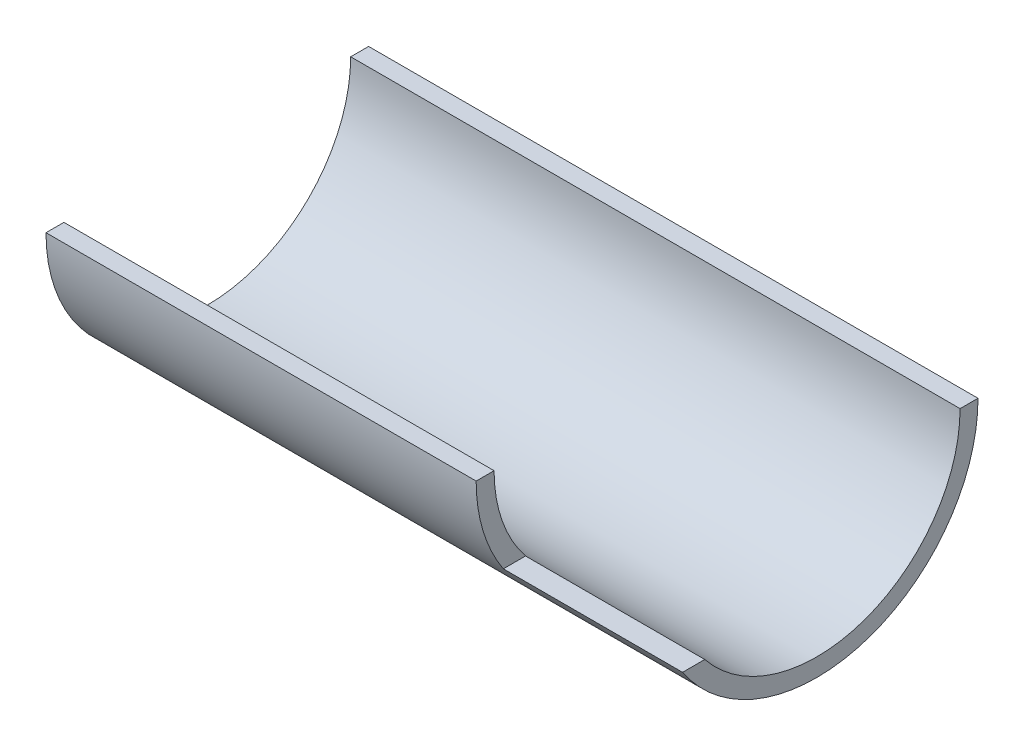
ISO-10303-21;
HEADER;
FILE_DESCRIPTION(('STEP AP214'),'2;1');
FILE_NAME('part.step','',(''),(''),'','','');
FILE_SCHEMA(('AUTOMOTIVE_DESIGN { 1 0 10303 214 1 1 1 1 }'));
ENDSEC;
DATA;
#1=APPLICATION_CONTEXT('core data for automotive mechanical design processes');
#2=APPLICATION_PROTOCOL_DEFINITION('international standard','automotive_design',2000,#1);
#3=PRODUCT_CONTEXT('',#1,'mechanical');
#4=PRODUCT('Part','Part','',(#3));
#5=PRODUCT_RELATED_PRODUCT_CATEGORY('part','',(#4));
#6=PRODUCT_DEFINITION_FORMATION('','',#4);
#7=PRODUCT_DEFINITION_CONTEXT('part definition',#1,'design');
#8=PRODUCT_DEFINITION('design','',#6,#7);
#9=PRODUCT_DEFINITION_SHAPE('','',#8);
#10=(LENGTH_UNIT() NAMED_UNIT(*) SI_UNIT(.MILLI.,.METRE.));
#11=(NAMED_UNIT(*) PLANE_ANGLE_UNIT() SI_UNIT($,.RADIAN.));
#12=(NAMED_UNIT(*) SI_UNIT($,.STERADIAN.) SOLID_ANGLE_UNIT());
#13=UNCERTAINTY_MEASURE_WITH_UNIT(LENGTH_MEASURE(1.E-05),#10,'distance_accuracy_value','');
#14=(GEOMETRIC_REPRESENTATION_CONTEXT(3) GLOBAL_UNCERTAINTY_ASSIGNED_CONTEXT((#13)) GLOBAL_UNIT_ASSIGNED_CONTEXT((#10,
#11,#12)) REPRESENTATION_CONTEXT('',''));
#15=CARTESIAN_POINT('',(0.,0.,0.));
#16=DIRECTION('',(0.,0.,1.));
#17=DIRECTION('',(1.,0.,0.));
#18=AXIS2_PLACEMENT_3D('',#15,#16,#17);
#19=CARTESIAN_POINT('',(-107.95,0.,25.4));
#20=DIRECTION('',(0.,1.,0.));
#21=DIRECTION('',(0.,0.,1.));
#22=AXIS2_PLACEMENT_3D('',#19,#20,#21);
#23=PLANE('',#22);
#24=DIRECTION('',(0.,0.,1.));
#25=VECTOR('',#24,1.);
#26=CARTESIAN_POINT('',(-107.95,0.,25.4));
#27=LINE('',#26,#25);
#28=CARTESIAN_POINT('',(-107.95,0.,25.4));
#29=VERTEX_POINT('',#28);
#30=CARTESIAN_POINT('',(-107.95,0.,28.575));
#31=VERTEX_POINT('',#30);
#32=EDGE_CURVE('E114',#29,#31,#27,.T.);
#33=ORIENTED_EDGE('',*,*,#32,.T.);
#34=DIRECTION('',(1.,0.,0.));
#35=VECTOR('',#34,1.);
#36=CARTESIAN_POINT('',(-107.95,0.,28.575));
#37=LINE('',#36,#35);
#38=CARTESIAN_POINT('',(-31.75,0.,28.575));
#39=VERTEX_POINT('',#38);
#40=EDGE_CURVE('E100',#31,#39,#37,.T.);
#41=ORIENTED_EDGE('',*,*,#40,.T.);
#42=DIRECTION('',(0.,0.,-1.));
#43=VECTOR('',#42,1.);
#44=CARTESIAN_POINT('',(-31.75,0.,127.));
#45=LINE('',#44,#43);
#46=CARTESIAN_POINT('',(-31.75,0.,25.4));
#47=VERTEX_POINT('',#46);
#48=EDGE_CURVE('E107',#39,#47,#45,.T.);
#49=ORIENTED_EDGE('',*,*,#48,.T.);
#50=DIRECTION('',(1.,0.,0.));
#51=VECTOR('',#50,1.);
#52=CARTESIAN_POINT('',(-107.95,0.,25.4));
#53=LINE('',#52,#51);
#54=EDGE_CURVE('E113',#29,#47,#53,.T.);
#55=ORIENTED_EDGE('',*,*,#54,.F.);
#56=EDGE_LOOP('',(#33,#41,#49,#55));
#57=FACE_BOUND('',#56,.T.);
#58=ADVANCED_FACE('F34',(#57),#23,.T.);
#59=CARTESIAN_POINT('',(0.,0.,0.));
#60=DIRECTION('',(1.,0.,0.));
#61=DIRECTION('',(0.,0.,-1.));
#62=AXIS2_PLACEMENT_3D('',#59,#60,#61);
#63=PLANE('',#62);
#64=DIRECTION('',(0.,0.,1.));
#65=VECTOR('',#64,1.);
#66=CARTESIAN_POINT('',(0.,-15.875,0.));
#67=LINE('',#66,#65);
#68=CARTESIAN_POINT('',(0.,-15.875,19.8278686449149));
#69=VERTEX_POINT('',#68);
#70=CARTESIAN_POINT('',(0.,-15.875,23.7595244060145));
#71=VERTEX_POINT('',#70);
#72=EDGE_CURVE('E42',#69,#71,#67,.T.);
#73=ORIENTED_EDGE('',*,*,#72,.T.);
#74=CARTESIAN_POINT('',(0.,0.,0.));
#75=DIRECTION('',(1.,0.,0.));
#76=DIRECTION('',(0.,0.,-1.));
#77=AXIS2_PLACEMENT_3D('',#74,#75,#76);
#78=CIRCLE('',#77,28.575);
#79=CARTESIAN_POINT('',(0.,0.,-28.575));
#80=VERTEX_POINT('',#79);
#81=EDGE_CURVE('E49',#71,#80,#78,.T.);
#82=ORIENTED_EDGE('',*,*,#81,.T.);
#83=DIRECTION('',(0.,0.,1.));
#84=VECTOR('',#83,1.);
#85=CARTESIAN_POINT('',(0.,0.,-31.75));
#86=LINE('',#85,#84);
#87=CARTESIAN_POINT('',(0.,0.,-25.4));
#88=VERTEX_POINT('',#87);
#89=EDGE_CURVE('E68',#80,#88,#86,.T.);
#90=ORIENTED_EDGE('',*,*,#89,.T.);
#91=CARTESIAN_POINT('',(0.,0.,0.));
#92=DIRECTION('',(-1.,0.,0.));
#93=DIRECTION('',(0.,0.,-1.));
#94=AXIS2_PLACEMENT_3D('',#91,#92,#93);
#95=CIRCLE('',#94,25.4);
#96=EDGE_CURVE('E122',#88,#69,#95,.T.);
#97=ORIENTED_EDGE('',*,*,#96,.T.);
#98=EDGE_LOOP('',(#73,#82,#90,#97));
#99=FACE_BOUND('',#98,.T.);
#100=ADVANCED_FACE('F127',(#99),#63,.T.);
#101=CARTESIAN_POINT('',(-107.95,0.,-31.75));
#102=DIRECTION('',(0.,1.,0.));
#103=DIRECTION('',(0.,0.,1.));
#104=AXIS2_PLACEMENT_3D('',#101,#102,#103);
#105=PLANE('',#104);
#106=ORIENTED_EDGE('',*,*,#89,.F.);
#107=DIRECTION('',(1.,0.,0.));
#108=VECTOR('',#107,1.);
#109=CARTESIAN_POINT('',(-107.95,0.,-28.575));
#110=LINE('',#109,#108);
#111=CARTESIAN_POINT('',(-107.95,0.,-28.575));
#112=VERTEX_POINT('',#111);
#113=EDGE_CURVE('E98',#80,#112,#110,.F.);
#114=ORIENTED_EDGE('',*,*,#113,.T.);
#115=DIRECTION('',(0.,0.,1.));
#116=VECTOR('',#115,1.);
#117=CARTESIAN_POINT('',(-107.95,0.,-31.75));
#118=LINE('',#117,#116);
#119=CARTESIAN_POINT('',(-107.95,0.,-25.4));
#120=VERTEX_POINT('',#119);
#121=EDGE_CURVE('E57',#112,#120,#118,.T.);
#122=ORIENTED_EDGE('',*,*,#121,.T.);
#123=DIRECTION('',(1.,0.,0.));
#124=VECTOR('',#123,1.);
#125=CARTESIAN_POINT('',(-107.95,0.,-25.4));
#126=LINE('',#125,#124);
#127=EDGE_CURVE('E117',#120,#88,#126,.T.);
#128=ORIENTED_EDGE('',*,*,#127,.T.);
#129=EDGE_LOOP('',(#106,#114,#122,#128));
#130=FACE_BOUND('',#129,.T.);
#131=ADVANCED_FACE('F106',(#130),#105,.T.);
#132=CARTESIAN_POINT('',(-107.95,0.,0.));
#133=DIRECTION('',(1.,0.,0.));
#134=DIRECTION('',(0.,0.,-1.));
#135=AXIS2_PLACEMENT_3D('',#132,#133,#134);
#136=PLANE('',#135);
#137=CARTESIAN_POINT('',(-107.95,0.,0.));
#138=DIRECTION('',(1.,0.,0.));
#139=DIRECTION('',(0.,0.,-1.));
#140=AXIS2_PLACEMENT_3D('',#137,#138,#139);
#141=CIRCLE('',#140,28.575);
#142=EDGE_CURVE('E96',#31,#112,#141,.T.);
#143=ORIENTED_EDGE('',*,*,#142,.F.);
#144=ORIENTED_EDGE('',*,*,#32,.F.);
#145=CARTESIAN_POINT('',(-107.95,0.,0.));
#146=DIRECTION('',(-1.,0.,0.));
#147=DIRECTION('',(0.,0.,-1.));
#148=AXIS2_PLACEMENT_3D('',#145,#146,#147);
#149=CIRCLE('',#148,25.4);
#150=EDGE_CURVE('E112',#120,#29,#149,.T.);
#151=ORIENTED_EDGE('',*,*,#150,.F.);
#152=ORIENTED_EDGE('',*,*,#121,.F.);
#153=EDGE_LOOP('',(#143,#144,#151,#152));
#154=FACE_BOUND('',#153,.T.);
#155=ADVANCED_FACE('F110',(#154),#136,.F.);
#156=CARTESIAN_POINT('',(-31.75,0.,127.));
#157=DIRECTION('',(1.,0.,0.));
#158=DIRECTION('',(0.,0.,-1.));
#159=AXIS2_PLACEMENT_3D('',#156,#157,#158);
#160=PLANE('',#159);
#161=ORIENTED_EDGE('',*,*,#48,.F.);
#162=CARTESIAN_POINT('',(-31.75,0.,0.));
#163=DIRECTION('',(1.,0.,0.));
#164=DIRECTION('',(0.,0.,-1.));
#165=AXIS2_PLACEMENT_3D('',#162,#163,#164);
#166=CIRCLE('',#165,28.575);
#167=CARTESIAN_POINT('',(-31.75,-15.875,23.7595244060145));
#168=VERTEX_POINT('',#167);
#169=EDGE_CURVE('E104',#39,#168,#166,.T.);
#170=ORIENTED_EDGE('',*,*,#169,.T.);
#171=DIRECTION('',(0.,0.,-1.));
#172=VECTOR('',#171,1.);
#173=CARTESIAN_POINT('',(-31.75,-15.875,127.));
#174=LINE('',#173,#172);
#175=CARTESIAN_POINT('',(-31.75,-15.875,19.8278686449149));
#176=VERTEX_POINT('',#175);
#177=EDGE_CURVE('E75',#168,#176,#174,.T.);
#178=ORIENTED_EDGE('',*,*,#177,.T.);
#179=CARTESIAN_POINT('',(-31.75,0.,0.));
#180=DIRECTION('',(1.,0.,0.));
#181=DIRECTION('',(0.,0.,-1.));
#182=AXIS2_PLACEMENT_3D('',#179,#180,#181);
#183=CIRCLE('',#182,25.4);
#184=EDGE_CURVE('E124',#47,#176,#183,.T.);
#185=ORIENTED_EDGE('',*,*,#184,.F.);
#186=EDGE_LOOP('',(#161,#170,#178,#185));
#187=FACE_BOUND('',#186,.T.);
#188=ADVANCED_FACE('F141',(#187),#160,.T.);
#189=CARTESIAN_POINT('',(-31.75,-15.875,127.));
#190=DIRECTION('',(0.,1.,0.));
#191=DIRECTION('',(-1.,0.,0.));
#192=AXIS2_PLACEMENT_3D('',#189,#190,#191);
#193=PLANE('',#192);
#194=ORIENTED_EDGE('',*,*,#177,.F.);
#195=DIRECTION('',(1.,0.,0.));
#196=VECTOR('',#195,1.);
#197=CARTESIAN_POINT('',(-107.95,-15.875,23.7595244060145));
#198=LINE('',#197,#196);
#199=EDGE_CURVE('E12',#168,#71,#198,.T.);
#200=ORIENTED_EDGE('',*,*,#199,.T.);
#201=ORIENTED_EDGE('',*,*,#72,.F.);
#202=DIRECTION('',(1.,0.,0.));
#203=VECTOR('',#202,1.);
#204=CARTESIAN_POINT('',(-107.95,-15.875,19.8278686449149));
#205=LINE('',#204,#203);
#206=EDGE_CURVE('E132',#176,#69,#205,.T.);
#207=ORIENTED_EDGE('',*,*,#206,.F.);
#208=EDGE_LOOP('',(#194,#200,#201,#207));
#209=FACE_BOUND('',#208,.T.);
#210=ADVANCED_FACE('F131',(#209),#193,.T.);
#211=CARTESIAN_POINT('',(-107.95,0.,0.));
#212=DIRECTION('',(1.,0.,0.));
#213=DIRECTION('',(0.,0.,-1.));
#214=AXIS2_PLACEMENT_3D('',#211,#212,#213);
#215=CYLINDRICAL_SURFACE('',#214,25.4);
#216=ORIENTED_EDGE('',*,*,#54,.T.);
#217=ORIENTED_EDGE('',*,*,#184,.T.);
#218=ORIENTED_EDGE('',*,*,#206,.T.);
#219=ORIENTED_EDGE('',*,*,#96,.F.);
#220=ORIENTED_EDGE('',*,*,#127,.F.);
#221=ORIENTED_EDGE('',*,*,#150,.T.);
#222=EDGE_LOOP('',(#216,#217,#218,#219,#220,#221));
#223=FACE_BOUND('',#222,.T.);
#224=ADVANCED_FACE('F36',(#223),#215,.F.);
#225=CARTESIAN_POINT('',(-107.95,0.,0.));
#226=DIRECTION('',(1.,0.,0.));
#227=DIRECTION('',(0.,0.,-1.));
#228=AXIS2_PLACEMENT_3D('',#225,#226,#227);
#229=CYLINDRICAL_SURFACE('',#228,28.575);
#230=ORIENTED_EDGE('',*,*,#81,.F.);
#231=ORIENTED_EDGE('',*,*,#199,.F.);
#232=ORIENTED_EDGE('',*,*,#169,.F.);
#233=ORIENTED_EDGE('',*,*,#40,.F.);
#234=ORIENTED_EDGE('',*,*,#142,.T.);
#235=ORIENTED_EDGE('',*,*,#113,.F.);
#236=EDGE_LOOP('',(#230,#231,#232,#233,#234,#235));
#237=FACE_BOUND('',#236,.T.);
#238=ADVANCED_FACE('F97',(#237),#229,.T.);
#239=CLOSED_SHELL('',(#58,#100,#131,#155,#188,#210,#224,#238));
#240=MANIFOLD_SOLID_BREP('B2',#239);
#241=ADVANCED_BREP_SHAPE_REPRESENTATION('',(#18,#240),#14);
#242=SHAPE_DEFINITION_REPRESENTATION(#9,#241);
ENDSEC;
END-ISO-10303-21;
